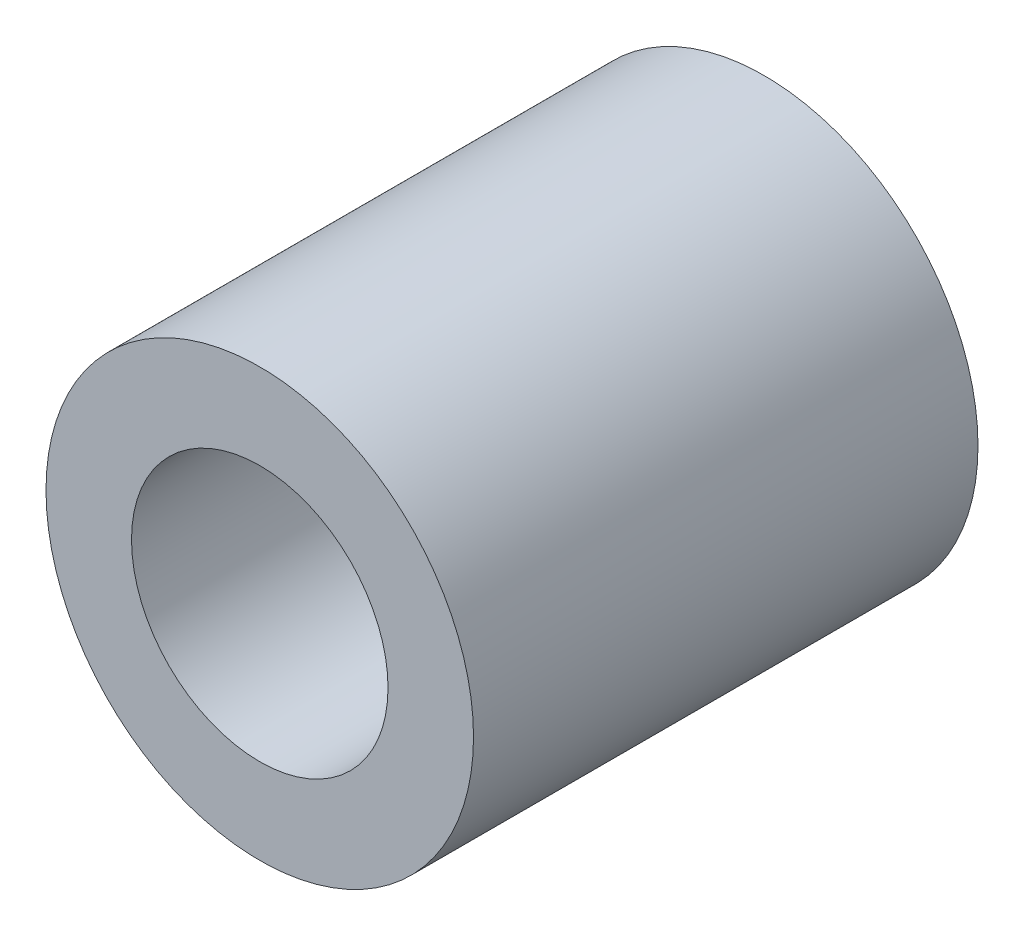
ISO-10303-21;
HEADER;
FILE_DESCRIPTION(('STEP AP214'),'2;1');
FILE_NAME('part.step','',(''),(''),'','','');
FILE_SCHEMA(('AUTOMOTIVE_DESIGN { 1 0 10303 214 1 1 1 1 }'));
ENDSEC;
DATA;
#1=APPLICATION_CONTEXT('core data for automotive mechanical design processes');
#2=APPLICATION_PROTOCOL_DEFINITION('international standard','automotive_design',2000,#1);
#3=PRODUCT_CONTEXT('',#1,'mechanical');
#4=PRODUCT('Part','Part','',(#3));
#5=PRODUCT_RELATED_PRODUCT_CATEGORY('part','',(#4));
#6=PRODUCT_DEFINITION_FORMATION('','',#4);
#7=PRODUCT_DEFINITION_CONTEXT('part definition',#1,'design');
#8=PRODUCT_DEFINITION('design','',#6,#7);
#9=PRODUCT_DEFINITION_SHAPE('','',#8);
#10=(LENGTH_UNIT() NAMED_UNIT(*) SI_UNIT(.MILLI.,.METRE.));
#11=(NAMED_UNIT(*) PLANE_ANGLE_UNIT() SI_UNIT($,.RADIAN.));
#12=(NAMED_UNIT(*) SI_UNIT($,.STERADIAN.) SOLID_ANGLE_UNIT());
#13=UNCERTAINTY_MEASURE_WITH_UNIT(LENGTH_MEASURE(1.E-05),#10,'distance_accuracy_value','');
#14=(GEOMETRIC_REPRESENTATION_CONTEXT(3) GLOBAL_UNCERTAINTY_ASSIGNED_CONTEXT((#13)) GLOBAL_UNIT_ASSIGNED_CONTEXT((#10,
#11,#12)) REPRESENTATION_CONTEXT('',''));
#15=CARTESIAN_POINT('',(0.,0.,0.));
#16=DIRECTION('',(0.,0.,1.));
#17=DIRECTION('',(1.,0.,0.));
#18=AXIS2_PLACEMENT_3D('',#15,#16,#17);
#19=CARTESIAN_POINT('',(0.,0.,5.9));
#20=DIRECTION('',(0.,0.,1.));
#21=DIRECTION('',(1.,0.,0.));
#22=AXIS2_PLACEMENT_3D('',#19,#20,#21);
#23=PLANE('',#22);
#24=CARTESIAN_POINT('',(0.,0.,5.9));
#25=DIRECTION('',(0.,0.,1.));
#26=DIRECTION('',(1.,0.,0.));
#27=AXIS2_PLACEMENT_3D('',#24,#25,#26);
#28=CIRCLE('',#27,2.5);
#29=CARTESIAN_POINT('',(2.5,0.,5.9));
#30=VERTEX_POINT('',#29);
#31=EDGE_CURVE('E10',#30,#30,#28,.T.);
#32=ORIENTED_EDGE('',*,*,#31,.T.);
#33=EDGE_LOOP('',(#32));
#34=FACE_BOUND('',#33,.T.);
#35=CARTESIAN_POINT('',(0.,0.,5.9));
#36=DIRECTION('',(0.,0.,1.));
#37=DIRECTION('',(1.,0.,0.));
#38=AXIS2_PLACEMENT_3D('',#35,#36,#37);
#39=CIRCLE('',#38,1.5);
#40=CARTESIAN_POINT('',(1.5,0.,5.9));
#41=VERTEX_POINT('',#40);
#42=EDGE_CURVE('E46',#41,#41,#39,.T.);
#43=ORIENTED_EDGE('',*,*,#42,.F.);
#44=EDGE_LOOP('',(#43));
#45=FACE_BOUND('',#44,.T.);
#46=ADVANCED_FACE('F35',(#34,#45),#23,.T.);
#47=CARTESIAN_POINT('',(0.,0.,0.));
#48=DIRECTION('',(0.,0.,1.));
#49=DIRECTION('',(1.,0.,0.));
#50=AXIS2_PLACEMENT_3D('',#47,#48,#49);
#51=PLANE('',#50);
#52=CARTESIAN_POINT('',(0.,0.,0.));
#53=DIRECTION('',(0.,0.,1.));
#54=DIRECTION('',(1.,0.,0.));
#55=AXIS2_PLACEMENT_3D('',#52,#53,#54);
#56=CIRCLE('',#55,2.5);
#57=CARTESIAN_POINT('',(2.5,0.,0.));
#58=VERTEX_POINT('',#57);
#59=EDGE_CURVE('E39',#58,#58,#56,.T.);
#60=ORIENTED_EDGE('',*,*,#59,.F.);
#61=EDGE_LOOP('',(#60));
#62=FACE_BOUND('',#61,.T.);
#63=CARTESIAN_POINT('',(0.,0.,0.));
#64=DIRECTION('',(0.,0.,1.));
#65=DIRECTION('',(1.,0.,0.));
#66=AXIS2_PLACEMENT_3D('',#63,#64,#65);
#67=CIRCLE('',#66,1.5);
#68=CARTESIAN_POINT('',(1.5,0.,0.));
#69=VERTEX_POINT('',#68);
#70=EDGE_CURVE('E48',#69,#69,#67,.T.);
#71=ORIENTED_EDGE('',*,*,#70,.T.);
#72=EDGE_LOOP('',(#71));
#73=FACE_BOUND('',#72,.T.);
#74=ADVANCED_FACE('F58',(#62,#73),#51,.F.);
#75=CARTESIAN_POINT('',(0.,0.,5.9));
#76=DIRECTION('',(0.,0.,-1.));
#77=DIRECTION('',(-1.,0.,0.));
#78=AXIS2_PLACEMENT_3D('',#75,#76,#77);
#79=CYLINDRICAL_SURFACE('',#78,2.5);
#80=ORIENTED_EDGE('',*,*,#31,.F.);
#81=EDGE_LOOP('',(#80));
#82=FACE_BOUND('',#81,.T.);
#83=ORIENTED_EDGE('',*,*,#59,.T.);
#84=EDGE_LOOP('',(#83));
#85=FACE_BOUND('',#84,.T.);
#86=ADVANCED_FACE('F37',(#82,#85),#79,.T.);
#87=CARTESIAN_POINT('',(0.,0.,5.9));
#88=DIRECTION('',(0.,0.,-1.));
#89=DIRECTION('',(-1.,0.,0.));
#90=AXIS2_PLACEMENT_3D('',#87,#88,#89);
#91=CYLINDRICAL_SURFACE('',#90,1.5);
#92=ORIENTED_EDGE('',*,*,#42,.T.);
#93=EDGE_LOOP('',(#92));
#94=FACE_BOUND('',#93,.T.);
#95=ORIENTED_EDGE('',*,*,#70,.F.);
#96=EDGE_LOOP('',(#95));
#97=FACE_BOUND('',#96,.T.);
#98=ADVANCED_FACE('F54',(#94,#97),#91,.F.);
#99=CLOSED_SHELL('',(#46,#74,#86,#98));
#100=MANIFOLD_SOLID_BREP('B2',#99);
#101=ADVANCED_BREP_SHAPE_REPRESENTATION('',(#18,#100),#14);
#102=SHAPE_DEFINITION_REPRESENTATION(#9,#101);
ENDSEC;
END-ISO-10303-21;
